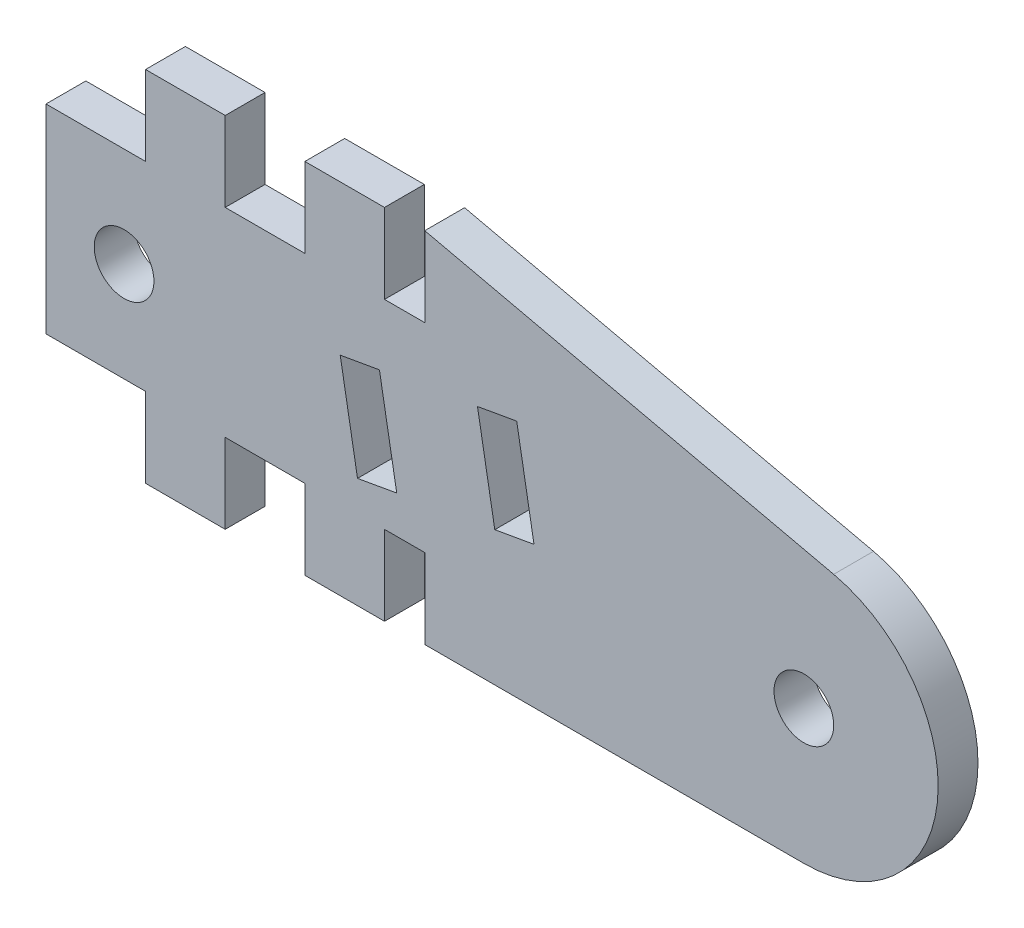
ISO-10303-21;
HEADER;
FILE_DESCRIPTION(('STEP AP214'),'2;1');
FILE_NAME('part.step','',(''),(''),'','','');
FILE_SCHEMA(('AUTOMOTIVE_DESIGN { 1 0 10303 214 1 1 1 1 }'));
ENDSEC;
DATA;
#1=APPLICATION_CONTEXT('core data for automotive mechanical design processes');
#2=APPLICATION_PROTOCOL_DEFINITION('international standard','automotive_design',2000,#1);
#3=PRODUCT_CONTEXT('',#1,'mechanical');
#4=PRODUCT('Part','Part','',(#3));
#5=PRODUCT_RELATED_PRODUCT_CATEGORY('part','',(#4));
#6=PRODUCT_DEFINITION_FORMATION('','',#4);
#7=PRODUCT_DEFINITION_CONTEXT('part definition',#1,'design');
#8=PRODUCT_DEFINITION('design','',#6,#7);
#9=PRODUCT_DEFINITION_SHAPE('','',#8);
#10=(LENGTH_UNIT() NAMED_UNIT(*) SI_UNIT(.MILLI.,.METRE.));
#11=(NAMED_UNIT(*) PLANE_ANGLE_UNIT() SI_UNIT($,.RADIAN.));
#12=(NAMED_UNIT(*) SI_UNIT($,.STERADIAN.) SOLID_ANGLE_UNIT());
#13=UNCERTAINTY_MEASURE_WITH_UNIT(LENGTH_MEASURE(1.E-05),#10,'distance_accuracy_value','');
#14=(GEOMETRIC_REPRESENTATION_CONTEXT(3) GLOBAL_UNCERTAINTY_ASSIGNED_CONTEXT((#13)) GLOBAL_UNIT_ASSIGNED_CONTEXT((#10,
#11,#12)) REPRESENTATION_CONTEXT('',''));
#15=CARTESIAN_POINT('',(0.,0.,0.));
#16=DIRECTION('',(0.,0.,1.));
#17=DIRECTION('',(1.,0.,0.));
#18=AXIS2_PLACEMENT_3D('',#15,#16,#17);
#19=CARTESIAN_POINT('',(38.05949585108,6.74534308282998,2.));
#20=DIRECTION('',(0.,0.,1.));
#21=DIRECTION('',(1.,0.,0.));
#22=AXIS2_PLACEMENT_3D('',#19,#20,#21);
#23=PLANE('',#22);
#24=CARTESIAN_POINT('',(3.92049009293526,8.99999999999998,2.));
#25=DIRECTION('',(0.,0.,1.));
#26=DIRECTION('',(1.,0.,0.));
#27=AXIS2_PLACEMENT_3D('',#24,#25,#26);
#28=CIRCLE('',#27,1.5);
#29=CARTESIAN_POINT('',(5.42049009293527,8.99999999999998,2.));
#30=VERTEX_POINT('',#29);
#31=EDGE_CURVE('E270',#30,#30,#28,.T.);
#32=ORIENTED_EDGE('',*,*,#31,.F.);
#33=EDGE_LOOP('',(#32));
#34=FACE_BOUND('',#33,.T.);
#35=DIRECTION('',(0.173648177666932,-0.984807753012208,0.));
#36=VECTOR('',#35,1.);
#37=CARTESIAN_POINT('',(14.7758795558328,10.4620193825306,2.));
#38=LINE('',#37,#36);
#39=CARTESIAN_POINT('',(14.7758795558328,10.4620193825306,2.));
#40=VERTEX_POINT('',#39);
#41=CARTESIAN_POINT('',(15.6441204441674,5.5379806174695,2.));
#42=VERTEX_POINT('',#41);
#43=EDGE_CURVE('E282',#40,#42,#38,.T.);
#44=ORIENTED_EDGE('',*,*,#43,.F.);
#45=DIRECTION('',(-0.984807753012208,-0.173648177666931,0.));
#46=VECTOR('',#45,1.);
#47=CARTESIAN_POINT('',(16.7454950618572,10.8093157378644,2.));
#48=LINE('',#47,#46);
#49=CARTESIAN_POINT('',(16.7454950618572,10.8093157378644,2.));
#50=VERTEX_POINT('',#49);
#51=EDGE_CURVE('E280',#50,#40,#48,.T.);
#52=ORIENTED_EDGE('',*,*,#51,.F.);
#53=DIRECTION('',(-0.173648177666932,0.984807753012208,0.));
#54=VECTOR('',#53,1.);
#55=CARTESIAN_POINT('',(16.7454950618572,10.8093157378644,2.));
#56=LINE('',#55,#54);
#57=CARTESIAN_POINT('',(17.6137359501918,5.88527697280338,2.));
#58=VERTEX_POINT('',#57);
#59=EDGE_CURVE('E288',#58,#50,#56,.T.);
#60=ORIENTED_EDGE('',*,*,#59,.F.);
#61=DIRECTION('',(0.984807753012206,0.173648177666941,0.));
#62=VECTOR('',#61,1.);
#63=CARTESIAN_POINT('',(15.6441204441674,5.5379806174695,2.));
#64=LINE('',#63,#62);
#65=EDGE_CURVE('E285',#42,#58,#64,.T.);
#66=ORIENTED_EDGE('',*,*,#65,.F.);
#67=EDGE_LOOP('',(#44,#52,#60,#66));
#68=FACE_BOUND('',#67,.T.);
#69=DIRECTION('',(0.,1.,0.));
#70=VECTOR('',#69,1.);
#71=CARTESIAN_POINT('',(9.,0.,2.));
#72=LINE('',#71,#70);
#73=CARTESIAN_POINT('',(9.,0.,2.));
#74=VERTEX_POINT('',#73);
#75=CARTESIAN_POINT('',(9.,4.,2.));
#76=VERTEX_POINT('',#75);
#77=EDGE_CURVE('E311',#74,#76,#72,.T.);
#78=ORIENTED_EDGE('',*,*,#77,.T.);
#79=DIRECTION('',(1.,0.,0.));
#80=VECTOR('',#79,1.);
#81=CARTESIAN_POINT('',(9.,4.,2.));
#82=LINE('',#81,#80);
#83=CARTESIAN_POINT('',(13.,4.,2.));
#84=VERTEX_POINT('',#83);
#85=EDGE_CURVE('E314',#76,#84,#82,.T.);
#86=ORIENTED_EDGE('',*,*,#85,.T.);
#87=DIRECTION('',(0.,-1.,0.));
#88=VECTOR('',#87,1.);
#89=CARTESIAN_POINT('',(13.,4.,2.));
#90=LINE('',#89,#88);
#91=CARTESIAN_POINT('',(13.,0.,2.));
#92=VERTEX_POINT('',#91);
#93=EDGE_CURVE('E317',#84,#92,#90,.T.);
#94=ORIENTED_EDGE('',*,*,#93,.T.);
#95=DIRECTION('',(1.,0.,0.));
#96=VECTOR('',#95,1.);
#97=CARTESIAN_POINT('',(13.,0.,2.));
#98=LINE('',#97,#96);
#99=CARTESIAN_POINT('',(17.,0.,2.));
#100=VERTEX_POINT('',#99);
#101=EDGE_CURVE('E319',#92,#100,#98,.T.);
#102=ORIENTED_EDGE('',*,*,#101,.T.);
#103=DIRECTION('',(0.,1.,0.));
#104=VECTOR('',#103,1.);
#105=CARTESIAN_POINT('',(17.,0.,2.));
#106=LINE('',#105,#104);
#107=CARTESIAN_POINT('',(17.,4.,2.));
#108=VERTEX_POINT('',#107);
#109=EDGE_CURVE('E321',#100,#108,#106,.T.);
#110=ORIENTED_EDGE('',*,*,#109,.T.);
#111=DIRECTION('',(1.,0.,0.));
#112=VECTOR('',#111,1.);
#113=CARTESIAN_POINT('',(17.,4.,2.));
#114=LINE('',#113,#112);
#115=CARTESIAN_POINT('',(19.0215619335038,4.,2.));
#116=VERTEX_POINT('',#115);
#117=EDGE_CURVE('E323',#108,#116,#114,.T.);
#118=ORIENTED_EDGE('',*,*,#117,.T.);
#119=DIRECTION('',(0.,-1.,0.));
#120=VECTOR('',#119,1.);
#121=CARTESIAN_POINT('',(19.0215619335038,4.,2.));
#122=LINE('',#121,#120);
#123=CARTESIAN_POINT('',(19.0215619335038,0.,2.));
#124=VERTEX_POINT('',#123);
#125=EDGE_CURVE('E325',#116,#124,#122,.T.);
#126=ORIENTED_EDGE('',*,*,#125,.T.);
#127=DIRECTION('',(1.,0.,0.));
#128=VECTOR('',#127,1.);
#129=CARTESIAN_POINT('',(19.0215619335038,0.,2.));
#130=LINE('',#129,#128);
#131=CARTESIAN_POINT('',(38.05949585108,0.,2.));
#132=VERTEX_POINT('',#131);
#133=EDGE_CURVE('E327',#124,#132,#130,.T.);
#134=ORIENTED_EDGE('',*,*,#133,.T.);
#135=CARTESIAN_POINT('',(38.05949585108,6.74534308282998,2.));
#136=DIRECTION('',(0.,0.,1.));
#137=DIRECTION('',(1.,0.,0.));
#138=AXIS2_PLACEMENT_3D('',#135,#136,#137);
#139=CIRCLE('',#138,6.74534308282998);
#140=CARTESIAN_POINT('',(39.5575990260467,13.3222222958182,2.));
#141=VERTEX_POINT('',#140);
#142=EDGE_CURVE('E329',#132,#141,#139,.T.);
#143=ORIENTED_EDGE('',*,*,#142,.T.);
#144=DIRECTION('',(-0.97502515916936,0.22209443709099,0.));
#145=VECTOR('',#144,1.);
#146=CARTESIAN_POINT('',(19.0215619335039,17.9999883567818,2.));
#147=LINE('',#146,#145);
#148=CARTESIAN_POINT('',(19.0215619335039,17.9999883567818,2.));
#149=VERTEX_POINT('',#148);
#150=EDGE_CURVE('E331',#141,#149,#147,.T.);
#151=ORIENTED_EDGE('',*,*,#150,.T.);
#152=DIRECTION('',(0.,-1.,0.));
#153=VECTOR('',#152,1.);
#154=CARTESIAN_POINT('',(19.0215619335038,13.9999883567817,2.));
#155=LINE('',#154,#153);
#156=CARTESIAN_POINT('',(19.0215619335038,13.9999883567817,2.));
#157=VERTEX_POINT('',#156);
#158=EDGE_CURVE('E333',#149,#157,#155,.T.);
#159=ORIENTED_EDGE('',*,*,#158,.T.);
#160=DIRECTION('',(-1.,0.,0.));
#161=VECTOR('',#160,1.);
#162=CARTESIAN_POINT('',(17.,13.9999883567817,2.));
#163=LINE('',#162,#161);
#164=CARTESIAN_POINT('',(17.,13.9999883567817,2.));
#165=VERTEX_POINT('',#164);
#166=EDGE_CURVE('E335',#157,#165,#163,.T.);
#167=ORIENTED_EDGE('',*,*,#166,.T.);
#168=DIRECTION('',(0.,1.,0.));
#169=VECTOR('',#168,1.);
#170=CARTESIAN_POINT('',(17.,17.9999883567817,2.));
#171=LINE('',#170,#169);
#172=CARTESIAN_POINT('',(17.,17.9999883567817,2.));
#173=VERTEX_POINT('',#172);
#174=EDGE_CURVE('E337',#165,#173,#171,.T.);
#175=ORIENTED_EDGE('',*,*,#174,.T.);
#176=DIRECTION('',(-1.,0.,0.));
#177=VECTOR('',#176,1.);
#178=CARTESIAN_POINT('',(13.,17.9999883567817,2.));
#179=LINE('',#178,#177);
#180=CARTESIAN_POINT('',(13.,17.9999883567817,2.));
#181=VERTEX_POINT('',#180);
#182=EDGE_CURVE('E339',#173,#181,#179,.T.);
#183=ORIENTED_EDGE('',*,*,#182,.T.);
#184=DIRECTION('',(0.,-1.,0.));
#185=VECTOR('',#184,1.);
#186=CARTESIAN_POINT('',(13.,13.9999883567817,2.));
#187=LINE('',#186,#185);
#188=CARTESIAN_POINT('',(13.,13.9999883567817,2.));
#189=VERTEX_POINT('',#188);
#190=EDGE_CURVE('E341',#181,#189,#187,.T.);
#191=ORIENTED_EDGE('',*,*,#190,.T.);
#192=DIRECTION('',(-1.,0.,0.));
#193=VECTOR('',#192,1.);
#194=CARTESIAN_POINT('',(9.,13.9999883567817,2.));
#195=LINE('',#194,#193);
#196=CARTESIAN_POINT('',(9.,13.9999883567817,2.));
#197=VERTEX_POINT('',#196);
#198=EDGE_CURVE('E343',#189,#197,#195,.T.);
#199=ORIENTED_EDGE('',*,*,#198,.T.);
#200=DIRECTION('',(0.,1.,0.));
#201=VECTOR('',#200,1.);
#202=CARTESIAN_POINT('',(9.,17.9999883567817,2.));
#203=LINE('',#202,#201);
#204=CARTESIAN_POINT('',(9.,17.9999883567817,2.));
#205=VERTEX_POINT('',#204);
#206=EDGE_CURVE('E345',#197,#205,#203,.T.);
#207=ORIENTED_EDGE('',*,*,#206,.T.);
#208=DIRECTION('',(-1.,0.,0.));
#209=VECTOR('',#208,1.);
#210=CARTESIAN_POINT('',(5.,17.9999883567817,2.));
#211=LINE('',#210,#209);
#212=CARTESIAN_POINT('',(5.,17.9999883567817,2.));
#213=VERTEX_POINT('',#212);
#214=EDGE_CURVE('E347',#205,#213,#211,.T.);
#215=ORIENTED_EDGE('',*,*,#214,.T.);
#216=DIRECTION('',(0.,-1.,0.));
#217=VECTOR('',#216,1.);
#218=CARTESIAN_POINT('',(5.,13.9999883567817,2.));
#219=LINE('',#218,#217);
#220=CARTESIAN_POINT('',(5.,13.9999883567817,2.));
#221=VERTEX_POINT('',#220);
#222=EDGE_CURVE('E349',#213,#221,#219,.T.);
#223=ORIENTED_EDGE('',*,*,#222,.T.);
#224=DIRECTION('',(-1.,0.,0.));
#225=VECTOR('',#224,1.);
#226=CARTESIAN_POINT('',(5.,13.9999883567817,2.));
#227=LINE('',#226,#225);
#228=CARTESIAN_POINT('',(0.,13.9999883567817,2.));
#229=VERTEX_POINT('',#228);
#230=EDGE_CURVE('E351',#221,#229,#227,.T.);
#231=ORIENTED_EDGE('',*,*,#230,.T.);
#232=DIRECTION('',(0.,-1.,0.));
#233=VECTOR('',#232,1.);
#234=CARTESIAN_POINT('',(0.,13.9999883567817,2.));
#235=LINE('',#234,#233);
#236=CARTESIAN_POINT('',(0.,4.,2.));
#237=VERTEX_POINT('',#236);
#238=EDGE_CURVE('E353',#229,#237,#235,.T.);
#239=ORIENTED_EDGE('',*,*,#238,.T.);
#240=DIRECTION('',(1.,0.,0.));
#241=VECTOR('',#240,1.);
#242=CARTESIAN_POINT('',(0.,4.,2.));
#243=LINE('',#242,#241);
#244=CARTESIAN_POINT('',(5.,4.,2.));
#245=VERTEX_POINT('',#244);
#246=EDGE_CURVE('E355',#237,#245,#243,.T.);
#247=ORIENTED_EDGE('',*,*,#246,.T.);
#248=DIRECTION('',(0.,-1.,0.));
#249=VECTOR('',#248,1.);
#250=CARTESIAN_POINT('',(5.,4.,2.));
#251=LINE('',#250,#249);
#252=CARTESIAN_POINT('',(5.,0.,2.));
#253=VERTEX_POINT('',#252);
#254=EDGE_CURVE('E357',#245,#253,#251,.T.);
#255=ORIENTED_EDGE('',*,*,#254,.T.);
#256=DIRECTION('',(1.,0.,0.));
#257=VECTOR('',#256,1.);
#258=CARTESIAN_POINT('',(5.,0.,2.));
#259=LINE('',#258,#257);
#260=EDGE_CURVE('E359',#253,#74,#259,.T.);
#261=ORIENTED_EDGE('',*,*,#260,.T.);
#262=EDGE_LOOP('',(#78,#86,#94,#102,#110,#118,#126,#134,#143,#151,#159,#167,#175,#183,#191,#199,
#207,#215,#223,#231,#239,#247,#255,#261));
#263=FACE_BOUND('',#262,.T.);
#264=DIRECTION('',(-0.984807753012208,-0.173648177666933,0.));
#265=VECTOR('',#264,1.);
#266=CARTESIAN_POINT('',(23.6391493329428,12.024852981533,2.));
#267=LINE('',#266,#265);
#268=CARTESIAN_POINT('',(23.6391493329428,12.024852981533,2.));
#269=VERTEX_POINT('',#268);
#270=CARTESIAN_POINT('',(21.6695338269183,11.6775566261991,2.));
#271=VERTEX_POINT('',#270);
#272=EDGE_CURVE('E249',#269,#271,#267,.T.);
#273=ORIENTED_EDGE('',*,*,#272,.F.);
#274=DIRECTION('',(-0.173648177666932,0.984807753012208,0.));
#275=VECTOR('',#274,1.);
#276=CARTESIAN_POINT('',(23.6391493329428,12.024852981533,2.));
#277=LINE('',#276,#275);
#278=CARTESIAN_POINT('',(24.5073902212774,7.10081421647191,2.));
#279=VERTEX_POINT('',#278);
#280=EDGE_CURVE('E241',#279,#269,#277,.T.);
#281=ORIENTED_EDGE('',*,*,#280,.F.);
#282=DIRECTION('',(0.984807753012208,0.173648177666932,0.));
#283=VECTOR('',#282,1.);
#284=CARTESIAN_POINT('',(22.537774715253,6.75351786113804,2.));
#285=LINE('',#284,#283);
#286=CARTESIAN_POINT('',(22.537774715253,6.75351786113804,2.));
#287=VERTEX_POINT('',#286);
#288=EDGE_CURVE('E264',#287,#279,#285,.T.);
#289=ORIENTED_EDGE('',*,*,#288,.F.);
#290=DIRECTION('',(0.173648177666932,-0.984807753012208,0.));
#291=VECTOR('',#290,1.);
#292=CARTESIAN_POINT('',(21.6695338269183,11.6775566261991,2.));
#293=LINE('',#292,#291);
#294=EDGE_CURVE('E262',#271,#287,#293,.T.);
#295=ORIENTED_EDGE('',*,*,#294,.F.);
#296=EDGE_LOOP('',(#273,#281,#289,#295));
#297=FACE_BOUND('',#296,.T.);
#298=CARTESIAN_POINT('',(38.05949585108,6.74534308282998,2.));
#299=DIRECTION('',(0.,0.,1.));
#300=DIRECTION('',(1.,0.,0.));
#301=AXIS2_PLACEMENT_3D('',#298,#299,#300);
#302=CIRCLE('',#301,1.5);
#303=CARTESIAN_POINT('',(39.55949585108,6.74534308282998,2.));
#304=VERTEX_POINT('',#303);
#305=EDGE_CURVE('E903',#304,#304,#302,.T.);
#306=ORIENTED_EDGE('',*,*,#305,.F.);
#307=EDGE_LOOP('',(#306));
#308=FACE_BOUND('',#307,.T.);
#309=ADVANCED_FACE('F32',(#34,#68,#263,#297,#308),#23,.T.);
#310=CARTESIAN_POINT('',(38.05949585108,6.74534308282998,0.));
#311=DIRECTION('',(0.,0.,1.));
#312=DIRECTION('',(1.,0.,0.));
#313=AXIS2_PLACEMENT_3D('',#310,#311,#312);
#314=PLANE('',#313);
#315=CARTESIAN_POINT('',(3.92049009293526,8.99999999999998,0.));
#316=DIRECTION('',(0.,0.,1.));
#317=DIRECTION('',(1.,0.,0.));
#318=AXIS2_PLACEMENT_3D('',#315,#316,#317);
#319=CIRCLE('',#318,1.5);
#320=CARTESIAN_POINT('',(5.42049009293527,8.99999999999998,0.));
#321=VERTEX_POINT('',#320);
#322=EDGE_CURVE('E909',#321,#321,#319,.T.);
#323=ORIENTED_EDGE('',*,*,#322,.T.);
#324=EDGE_LOOP('',(#323));
#325=FACE_BOUND('',#324,.T.);
#326=DIRECTION('',(-0.984807753012208,-0.173648177666931,0.));
#327=VECTOR('',#326,1.);
#328=CARTESIAN_POINT('',(16.7454950618572,10.8093157378644,0.));
#329=LINE('',#328,#327);
#330=CARTESIAN_POINT('',(16.7454950618572,10.8093157378644,0.));
#331=VERTEX_POINT('',#330);
#332=CARTESIAN_POINT('',(14.7758795558328,10.4620193825306,0.));
#333=VERTEX_POINT('',#332);
#334=EDGE_CURVE('E257',#331,#333,#329,.T.);
#335=ORIENTED_EDGE('',*,*,#334,.T.);
#336=DIRECTION('',(0.173648177666932,-0.984807753012208,0.));
#337=VECTOR('',#336,1.);
#338=CARTESIAN_POINT('',(14.7758795558328,10.4620193825306,0.));
#339=LINE('',#338,#337);
#340=CARTESIAN_POINT('',(15.6441204441674,5.5379806174695,0.));
#341=VERTEX_POINT('',#340);
#342=EDGE_CURVE('E293',#333,#341,#339,.T.);
#343=ORIENTED_EDGE('',*,*,#342,.T.);
#344=DIRECTION('',(0.984807753012206,0.173648177666941,0.));
#345=VECTOR('',#344,1.);
#346=CARTESIAN_POINT('',(15.6441204441674,5.5379806174695,0.));
#347=LINE('',#346,#345);
#348=CARTESIAN_POINT('',(17.6137359501918,5.88527697280338,0.));
#349=VERTEX_POINT('',#348);
#350=EDGE_CURVE('E296',#341,#349,#347,.T.);
#351=ORIENTED_EDGE('',*,*,#350,.T.);
#352=DIRECTION('',(-0.173648177666932,0.984807753012208,0.));
#353=VECTOR('',#352,1.);
#354=CARTESIAN_POINT('',(16.7454950618572,10.8093157378644,0.));
#355=LINE('',#354,#353);
#356=EDGE_CURVE('E283',#349,#331,#355,.T.);
#357=ORIENTED_EDGE('',*,*,#356,.T.);
#358=EDGE_LOOP('',(#335,#343,#351,#357));
#359=FACE_BOUND('',#358,.T.);
#360=DIRECTION('',(0.,1.,0.));
#361=VECTOR('',#360,1.);
#362=CARTESIAN_POINT('',(9.,0.,0.));
#363=LINE('',#362,#361);
#364=CARTESIAN_POINT('',(9.,0.,0.));
#365=VERTEX_POINT('',#364);
#366=CARTESIAN_POINT('',(9.,4.,0.));
#367=VERTEX_POINT('',#366);
#368=EDGE_CURVE('E310',#365,#367,#363,.T.);
#369=ORIENTED_EDGE('',*,*,#368,.F.);
#370=DIRECTION('',(1.,0.,0.));
#371=VECTOR('',#370,1.);
#372=CARTESIAN_POINT('',(5.,0.,0.));
#373=LINE('',#372,#371);
#374=CARTESIAN_POINT('',(5.,0.,0.));
#375=VERTEX_POINT('',#374);
#376=EDGE_CURVE('E315',#375,#365,#373,.T.);
#377=ORIENTED_EDGE('',*,*,#376,.F.);
#378=DIRECTION('',(0.,-1.,0.));
#379=VECTOR('',#378,1.);
#380=CARTESIAN_POINT('',(5.,4.,0.));
#381=LINE('',#380,#379);
#382=CARTESIAN_POINT('',(5.,4.,0.));
#383=VERTEX_POINT('',#382);
#384=EDGE_CURVE('E406',#383,#375,#381,.T.);
#385=ORIENTED_EDGE('',*,*,#384,.F.);
#386=DIRECTION('',(1.,0.,0.));
#387=VECTOR('',#386,1.);
#388=CARTESIAN_POINT('',(0.,4.,0.));
#389=LINE('',#388,#387);
#390=CARTESIAN_POINT('',(0.,4.,0.));
#391=VERTEX_POINT('',#390);
#392=EDGE_CURVE('E404',#391,#383,#389,.T.);
#393=ORIENTED_EDGE('',*,*,#392,.F.);
#394=DIRECTION('',(0.,-1.,0.));
#395=VECTOR('',#394,1.);
#396=CARTESIAN_POINT('',(0.,13.9999883567817,0.));
#397=LINE('',#396,#395);
#398=CARTESIAN_POINT('',(0.,13.9999883567817,0.));
#399=VERTEX_POINT('',#398);
#400=EDGE_CURVE('E402',#399,#391,#397,.T.);
#401=ORIENTED_EDGE('',*,*,#400,.F.);
#402=DIRECTION('',(-1.,0.,0.));
#403=VECTOR('',#402,1.);
#404=CARTESIAN_POINT('',(5.,13.9999883567817,0.));
#405=LINE('',#404,#403);
#406=CARTESIAN_POINT('',(5.,13.9999883567817,0.));
#407=VERTEX_POINT('',#406);
#408=EDGE_CURVE('E400',#407,#399,#405,.T.);
#409=ORIENTED_EDGE('',*,*,#408,.F.);
#410=DIRECTION('',(0.,-1.,0.));
#411=VECTOR('',#410,1.);
#412=CARTESIAN_POINT('',(5.,13.9999883567817,0.));
#413=LINE('',#412,#411);
#414=CARTESIAN_POINT('',(5.,17.9999883567817,0.));
#415=VERTEX_POINT('',#414);
#416=EDGE_CURVE('E398',#415,#407,#413,.T.);
#417=ORIENTED_EDGE('',*,*,#416,.F.);
#418=DIRECTION('',(-1.,0.,0.));
#419=VECTOR('',#418,1.);
#420=CARTESIAN_POINT('',(5.,17.9999883567817,0.));
#421=LINE('',#420,#419);
#422=CARTESIAN_POINT('',(9.,17.9999883567817,0.));
#423=VERTEX_POINT('',#422);
#424=EDGE_CURVE('E396',#423,#415,#421,.T.);
#425=ORIENTED_EDGE('',*,*,#424,.F.);
#426=DIRECTION('',(0.,1.,0.));
#427=VECTOR('',#426,1.);
#428=CARTESIAN_POINT('',(9.,17.9999883567817,0.));
#429=LINE('',#428,#427);
#430=CARTESIAN_POINT('',(9.,13.9999883567817,0.));
#431=VERTEX_POINT('',#430);
#432=EDGE_CURVE('E394',#431,#423,#429,.T.);
#433=ORIENTED_EDGE('',*,*,#432,.F.);
#434=DIRECTION('',(-1.,0.,0.));
#435=VECTOR('',#434,1.);
#436=CARTESIAN_POINT('',(9.,13.9999883567817,0.));
#437=LINE('',#436,#435);
#438=CARTESIAN_POINT('',(13.,13.9999883567817,0.));
#439=VERTEX_POINT('',#438);
#440=EDGE_CURVE('E392',#439,#431,#437,.T.);
#441=ORIENTED_EDGE('',*,*,#440,.F.);
#442=DIRECTION('',(0.,-1.,0.));
#443=VECTOR('',#442,1.);
#444=CARTESIAN_POINT('',(13.,13.9999883567817,0.));
#445=LINE('',#444,#443);
#446=CARTESIAN_POINT('',(13.,17.9999883567817,0.));
#447=VERTEX_POINT('',#446);
#448=EDGE_CURVE('E390',#447,#439,#445,.T.);
#449=ORIENTED_EDGE('',*,*,#448,.F.);
#450=DIRECTION('',(-1.,0.,0.));
#451=VECTOR('',#450,1.);
#452=CARTESIAN_POINT('',(13.,17.9999883567817,0.));
#453=LINE('',#452,#451);
#454=CARTESIAN_POINT('',(17.,17.9999883567817,0.));
#455=VERTEX_POINT('',#454);
#456=EDGE_CURVE('E388',#455,#447,#453,.T.);
#457=ORIENTED_EDGE('',*,*,#456,.F.);
#458=DIRECTION('',(0.,1.,0.));
#459=VECTOR('',#458,1.);
#460=CARTESIAN_POINT('',(17.,17.9999883567817,0.));
#461=LINE('',#460,#459);
#462=CARTESIAN_POINT('',(17.,13.9999883567817,0.));
#463=VERTEX_POINT('',#462);
#464=EDGE_CURVE('E386',#463,#455,#461,.T.);
#465=ORIENTED_EDGE('',*,*,#464,.F.);
#466=DIRECTION('',(-1.,0.,0.));
#467=VECTOR('',#466,1.);
#468=CARTESIAN_POINT('',(17.,13.9999883567817,0.));
#469=LINE('',#468,#467);
#470=CARTESIAN_POINT('',(19.0215619335038,13.9999883567817,0.));
#471=VERTEX_POINT('',#470);
#472=EDGE_CURVE('E384',#471,#463,#469,.T.);
#473=ORIENTED_EDGE('',*,*,#472,.F.);
#474=DIRECTION('',(0.,-1.,0.));
#475=VECTOR('',#474,1.);
#476=CARTESIAN_POINT('',(19.0215619335038,13.9999883567817,0.));
#477=LINE('',#476,#475);
#478=CARTESIAN_POINT('',(19.0215619335039,17.9999883567818,0.));
#479=VERTEX_POINT('',#478);
#480=EDGE_CURVE('E382',#479,#471,#477,.T.);
#481=ORIENTED_EDGE('',*,*,#480,.F.);
#482=DIRECTION('',(-0.97502515916936,0.22209443709099,0.));
#483=VECTOR('',#482,1.);
#484=CARTESIAN_POINT('',(19.0215619335039,17.9999883567818,0.));
#485=LINE('',#484,#483);
#486=CARTESIAN_POINT('',(39.5575990260467,13.3222222958182,0.));
#487=VERTEX_POINT('',#486);
#488=EDGE_CURVE('E380',#487,#479,#485,.T.);
#489=ORIENTED_EDGE('',*,*,#488,.F.);
#490=CARTESIAN_POINT('',(38.05949585108,6.74534308282998,0.));
#491=DIRECTION('',(0.,0.,1.));
#492=DIRECTION('',(1.,0.,0.));
#493=AXIS2_PLACEMENT_3D('',#490,#491,#492);
#494=CIRCLE('',#493,6.74534308282998);
#495=CARTESIAN_POINT('',(38.05949585108,0.,0.));
#496=VERTEX_POINT('',#495);
#497=EDGE_CURVE('E378',#496,#487,#494,.T.);
#498=ORIENTED_EDGE('',*,*,#497,.F.);
#499=DIRECTION('',(1.,0.,0.));
#500=VECTOR('',#499,1.);
#501=CARTESIAN_POINT('',(19.0215619335038,0.,0.));
#502=LINE('',#501,#500);
#503=CARTESIAN_POINT('',(19.0215619335038,0.,0.));
#504=VERTEX_POINT('',#503);
#505=EDGE_CURVE('E376',#504,#496,#502,.T.);
#506=ORIENTED_EDGE('',*,*,#505,.F.);
#507=DIRECTION('',(0.,-1.,0.));
#508=VECTOR('',#507,1.);
#509=CARTESIAN_POINT('',(19.0215619335038,4.,0.));
#510=LINE('',#509,#508);
#511=CARTESIAN_POINT('',(19.0215619335038,4.,0.));
#512=VERTEX_POINT('',#511);
#513=EDGE_CURVE('E374',#512,#504,#510,.T.);
#514=ORIENTED_EDGE('',*,*,#513,.F.);
#515=DIRECTION('',(1.,0.,0.));
#516=VECTOR('',#515,1.);
#517=CARTESIAN_POINT('',(17.,4.,0.));
#518=LINE('',#517,#516);
#519=CARTESIAN_POINT('',(17.,4.,0.));
#520=VERTEX_POINT('',#519);
#521=EDGE_CURVE('E372',#520,#512,#518,.T.);
#522=ORIENTED_EDGE('',*,*,#521,.F.);
#523=DIRECTION('',(0.,1.,0.));
#524=VECTOR('',#523,1.);
#525=CARTESIAN_POINT('',(17.,0.,0.));
#526=LINE('',#525,#524);
#527=CARTESIAN_POINT('',(17.,0.,0.));
#528=VERTEX_POINT('',#527);
#529=EDGE_CURVE('E370',#528,#520,#526,.T.);
#530=ORIENTED_EDGE('',*,*,#529,.F.);
#531=DIRECTION('',(1.,0.,0.));
#532=VECTOR('',#531,1.);
#533=CARTESIAN_POINT('',(13.,0.,0.));
#534=LINE('',#533,#532);
#535=CARTESIAN_POINT('',(13.,0.,0.));
#536=VERTEX_POINT('',#535);
#537=EDGE_CURVE('E368',#536,#528,#534,.T.);
#538=ORIENTED_EDGE('',*,*,#537,.F.);
#539=DIRECTION('',(0.,-1.,0.));
#540=VECTOR('',#539,1.);
#541=CARTESIAN_POINT('',(13.,4.,0.));
#542=LINE('',#541,#540);
#543=CARTESIAN_POINT('',(13.,4.,0.));
#544=VERTEX_POINT('',#543);
#545=EDGE_CURVE('E366',#544,#536,#542,.T.);
#546=ORIENTED_EDGE('',*,*,#545,.F.);
#547=DIRECTION('',(1.,0.,0.));
#548=VECTOR('',#547,1.);
#549=CARTESIAN_POINT('',(9.,4.,0.));
#550=LINE('',#549,#548);
#551=EDGE_CURVE('E364',#367,#544,#550,.T.);
#552=ORIENTED_EDGE('',*,*,#551,.F.);
#553=EDGE_LOOP('',(#369,#377,#385,#393,#401,#409,#417,#425,#433,#441,#449,#457,#465,#473,#481,
#489,#498,#506,#514,#522,#530,#538,#546,#552));
#554=FACE_BOUND('',#553,.T.);
#555=DIRECTION('',(-0.173648177666932,0.984807753012208,0.));
#556=VECTOR('',#555,1.);
#557=CARTESIAN_POINT('',(23.6391493329428,12.024852981533,0.));
#558=LINE('',#557,#556);
#559=CARTESIAN_POINT('',(24.5073902212774,7.10081421647191,0.));
#560=VERTEX_POINT('',#559);
#561=CARTESIAN_POINT('',(23.6391493329428,12.024852981533,0.));
#562=VERTEX_POINT('',#561);
#563=EDGE_CURVE('E55',#560,#562,#558,.T.);
#564=ORIENTED_EDGE('',*,*,#563,.T.);
#565=DIRECTION('',(-0.984807753012208,-0.173648177666933,0.));
#566=VECTOR('',#565,1.);
#567=CARTESIAN_POINT('',(23.6391493329428,12.024852981533,0.));
#568=LINE('',#567,#566);
#569=CARTESIAN_POINT('',(21.6695338269183,11.6775566261991,0.));
#570=VERTEX_POINT('',#569);
#571=EDGE_CURVE('E256',#562,#570,#568,.T.);
#572=ORIENTED_EDGE('',*,*,#571,.T.);
#573=DIRECTION('',(0.173648177666932,-0.984807753012208,0.));
#574=VECTOR('',#573,1.);
#575=CARTESIAN_POINT('',(21.6695338269183,11.6775566261991,0.));
#576=LINE('',#575,#574);
#577=CARTESIAN_POINT('',(22.537774715253,6.75351786113804,0.));
#578=VERTEX_POINT('',#577);
#579=EDGE_CURVE('E272',#570,#578,#576,.T.);
#580=ORIENTED_EDGE('',*,*,#579,.T.);
#581=DIRECTION('',(0.984807753012208,0.173648177666932,0.));
#582=VECTOR('',#581,1.);
#583=CARTESIAN_POINT('',(22.537774715253,6.75351786113804,0.));
#584=LINE('',#583,#582);
#585=EDGE_CURVE('E250',#578,#560,#584,.T.);
#586=ORIENTED_EDGE('',*,*,#585,.T.);
#587=EDGE_LOOP('',(#564,#572,#580,#586));
#588=FACE_BOUND('',#587,.T.);
#589=CARTESIAN_POINT('',(38.05949585108,6.74534308282998,0.));
#590=DIRECTION('',(0.,0.,1.));
#591=DIRECTION('',(1.,0.,0.));
#592=AXIS2_PLACEMENT_3D('',#589,#590,#591);
#593=CIRCLE('',#592,1.5);
#594=CARTESIAN_POINT('',(39.55949585108,6.74534308282998,0.));
#595=VERTEX_POINT('',#594);
#596=EDGE_CURVE('E906',#595,#595,#593,.T.);
#597=ORIENTED_EDGE('',*,*,#596,.T.);
#598=EDGE_LOOP('',(#597));
#599=FACE_BOUND('',#598,.T.);
#600=ADVANCED_FACE('F484',(#325,#359,#554,#588,#599),#314,.F.);
#601=CARTESIAN_POINT('',(9.,0.,2.));
#602=DIRECTION('',(-1.,0.,0.));
#603=DIRECTION('',(0.,0.,1.));
#604=AXIS2_PLACEMENT_3D('',#601,#602,#603);
#605=PLANE('',#604);
#606=ORIENTED_EDGE('',*,*,#368,.T.);
#607=DIRECTION('',(0.,0.,-1.));
#608=VECTOR('',#607,1.);
#609=CARTESIAN_POINT('',(9.,4.,2.));
#610=LINE('',#609,#608);
#611=EDGE_CURVE('E11',#76,#367,#610,.T.);
#612=ORIENTED_EDGE('',*,*,#611,.F.);
#613=ORIENTED_EDGE('',*,*,#77,.F.);
#614=DIRECTION('',(0.,0.,-1.));
#615=VECTOR('',#614,1.);
#616=CARTESIAN_POINT('',(9.,0.,2.));
#617=LINE('',#616,#615);
#618=EDGE_CURVE('E361',#74,#365,#617,.T.);
#619=ORIENTED_EDGE('',*,*,#618,.T.);
#620=EDGE_LOOP('',(#606,#612,#613,#619));
#621=FACE_BOUND('',#620,.T.);
#622=ADVANCED_FACE('F34',(#621),#605,.F.);
#623=CARTESIAN_POINT('',(9.,4.,2.));
#624=DIRECTION('',(0.,1.,0.));
#625=DIRECTION('',(0.,0.,1.));
#626=AXIS2_PLACEMENT_3D('',#623,#624,#625);
#627=PLANE('',#626);
#628=ORIENTED_EDGE('',*,*,#551,.T.);
#629=DIRECTION('',(0.,0.,-1.));
#630=VECTOR('',#629,1.);
#631=CARTESIAN_POINT('',(13.,4.,2.));
#632=LINE('',#631,#630);
#633=EDGE_CURVE('E40',#84,#544,#632,.T.);
#634=ORIENTED_EDGE('',*,*,#633,.F.);
#635=ORIENTED_EDGE('',*,*,#85,.F.);
#636=ORIENTED_EDGE('',*,*,#611,.T.);
#637=EDGE_LOOP('',(#628,#634,#635,#636));
#638=FACE_BOUND('',#637,.T.);
#639=ADVANCED_FACE('F501',(#638),#627,.F.);
#640=CARTESIAN_POINT('',(13.,4.,2.));
#641=DIRECTION('',(1.,0.,0.));
#642=DIRECTION('',(0.,1.,0.));
#643=AXIS2_PLACEMENT_3D('',#640,#641,#642);
#644=PLANE('',#643);
#645=ORIENTED_EDGE('',*,*,#545,.T.);
#646=DIRECTION('',(0.,0.,-1.));
#647=VECTOR('',#646,1.);
#648=CARTESIAN_POINT('',(13.,0.,2.));
#649=LINE('',#648,#647);
#650=EDGE_CURVE('E471',#92,#536,#649,.T.);
#651=ORIENTED_EDGE('',*,*,#650,.F.);
#652=ORIENTED_EDGE('',*,*,#93,.F.);
#653=ORIENTED_EDGE('',*,*,#633,.T.);
#654=EDGE_LOOP('',(#645,#651,#652,#653));
#655=FACE_BOUND('',#654,.T.);
#656=ADVANCED_FACE('F478',(#655),#644,.F.);
#657=CARTESIAN_POINT('',(13.,0.,2.));
#658=DIRECTION('',(0.,1.,0.));
#659=DIRECTION('',(-1.,0.,0.));
#660=AXIS2_PLACEMENT_3D('',#657,#658,#659);
#661=PLANE('',#660);
#662=ORIENTED_EDGE('',*,*,#537,.T.);
#663=DIRECTION('',(0.,0.,-1.));
#664=VECTOR('',#663,1.);
#665=CARTESIAN_POINT('',(17.,0.,2.));
#666=LINE('',#665,#664);
#667=EDGE_CURVE('E468',#100,#528,#666,.T.);
#668=ORIENTED_EDGE('',*,*,#667,.F.);
#669=ORIENTED_EDGE('',*,*,#101,.F.);
#670=ORIENTED_EDGE('',*,*,#650,.T.);
#671=EDGE_LOOP('',(#662,#668,#669,#670));
#672=FACE_BOUND('',#671,.T.);
#673=ADVANCED_FACE('F490',(#672),#661,.F.);
#674=CARTESIAN_POINT('',(17.,0.,2.));
#675=DIRECTION('',(-1.,0.,0.));
#676=DIRECTION('',(0.,0.,1.));
#677=AXIS2_PLACEMENT_3D('',#674,#675,#676);
#678=PLANE('',#677);
#679=ORIENTED_EDGE('',*,*,#529,.T.);
#680=DIRECTION('',(0.,0.,-1.));
#681=VECTOR('',#680,1.);
#682=CARTESIAN_POINT('',(17.,4.,2.));
#683=LINE('',#682,#681);
#684=EDGE_CURVE('E465',#108,#520,#683,.T.);
#685=ORIENTED_EDGE('',*,*,#684,.F.);
#686=ORIENTED_EDGE('',*,*,#109,.F.);
#687=ORIENTED_EDGE('',*,*,#667,.T.);
#688=EDGE_LOOP('',(#679,#685,#686,#687));
#689=FACE_BOUND('',#688,.T.);
#690=ADVANCED_FACE('F494',(#689),#678,.F.);
#691=CARTESIAN_POINT('',(17.,4.,2.));
#692=DIRECTION('',(0.,1.,0.));
#693=DIRECTION('',(0.,0.,1.));
#694=AXIS2_PLACEMENT_3D('',#691,#692,#693);
#695=PLANE('',#694);
#696=ORIENTED_EDGE('',*,*,#521,.T.);
#697=DIRECTION('',(0.,0.,-1.));
#698=VECTOR('',#697,1.);
#699=CARTESIAN_POINT('',(19.0215619335038,4.,2.));
#700=LINE('',#699,#698);
#701=EDGE_CURVE('E462',#116,#512,#700,.T.);
#702=ORIENTED_EDGE('',*,*,#701,.F.);
#703=ORIENTED_EDGE('',*,*,#117,.F.);
#704=ORIENTED_EDGE('',*,*,#684,.T.);
#705=EDGE_LOOP('',(#696,#702,#703,#704));
#706=FACE_BOUND('',#705,.T.);
#707=ADVANCED_FACE('F594',(#706),#695,.F.);
#708=CARTESIAN_POINT('',(19.0215619335038,4.,2.));
#709=DIRECTION('',(1.,0.,0.));
#710=DIRECTION('',(0.,0.,-1.));
#711=AXIS2_PLACEMENT_3D('',#708,#709,#710);
#712=PLANE('',#711);
#713=ORIENTED_EDGE('',*,*,#513,.T.);
#714=DIRECTION('',(0.,0.,-1.));
#715=VECTOR('',#714,1.);
#716=CARTESIAN_POINT('',(19.0215619335038,0.,2.));
#717=LINE('',#716,#715);
#718=EDGE_CURVE('E459',#124,#504,#717,.T.);
#719=ORIENTED_EDGE('',*,*,#718,.F.);
#720=ORIENTED_EDGE('',*,*,#125,.F.);
#721=ORIENTED_EDGE('',*,*,#701,.T.);
#722=EDGE_LOOP('',(#713,#719,#720,#721));
#723=FACE_BOUND('',#722,.T.);
#724=ADVANCED_FACE('F592',(#723),#712,.F.);
#725=CARTESIAN_POINT('',(19.0215619335038,0.,2.));
#726=DIRECTION('',(0.,1.,0.));
#727=DIRECTION('',(0.,0.,1.));
#728=AXIS2_PLACEMENT_3D('',#725,#726,#727);
#729=PLANE('',#728);
#730=ORIENTED_EDGE('',*,*,#505,.T.);
#731=DIRECTION('',(0.,0.,-1.));
#732=VECTOR('',#731,1.);
#733=CARTESIAN_POINT('',(38.05949585108,0.,2.));
#734=LINE('',#733,#732);
#735=EDGE_CURVE('E456',#132,#496,#734,.T.);
#736=ORIENTED_EDGE('',*,*,#735,.F.);
#737=ORIENTED_EDGE('',*,*,#133,.F.);
#738=ORIENTED_EDGE('',*,*,#718,.T.);
#739=EDGE_LOOP('',(#730,#736,#737,#738));
#740=FACE_BOUND('',#739,.T.);
#741=ADVANCED_FACE('F588',(#740),#729,.F.);
#742=CARTESIAN_POINT('',(38.05949585108,6.74534308282998,2.));
#743=DIRECTION('',(0.,0.,-1.));
#744=DIRECTION('',(-1.,0.,0.));
#745=AXIS2_PLACEMENT_3D('',#742,#743,#744);
#746=CYLINDRICAL_SURFACE('',#745,6.74534308282998);
#747=ORIENTED_EDGE('',*,*,#497,.T.);
#748=DIRECTION('',(0.,0.,-1.));
#749=VECTOR('',#748,1.);
#750=CARTESIAN_POINT('',(39.5575990260467,13.3222222958182,2.));
#751=LINE('',#750,#749);
#752=EDGE_CURVE('E453',#141,#487,#751,.T.);
#753=ORIENTED_EDGE('',*,*,#752,.F.);
#754=ORIENTED_EDGE('',*,*,#142,.F.);
#755=ORIENTED_EDGE('',*,*,#735,.T.);
#756=EDGE_LOOP('',(#747,#753,#754,#755));
#757=FACE_BOUND('',#756,.T.);
#758=ADVANCED_FACE('F583',(#757),#746,.T.);
#759=CARTESIAN_POINT('',(19.0215619335039,17.9999883567818,2.));
#760=DIRECTION('',(-0.22209443709099,-0.97502515916936,0.));
#761=DIRECTION('',(0.97502515916936,-0.22209443709099,0.));
#762=AXIS2_PLACEMENT_3D('',#759,#760,#761);
#763=PLANE('',#762);
#764=ORIENTED_EDGE('',*,*,#488,.T.);
#765=DIRECTION('',(0.,0.,-1.));
#766=VECTOR('',#765,1.);
#767=CARTESIAN_POINT('',(19.0215619335039,17.9999883567818,2.));
#768=LINE('',#767,#766);
#769=EDGE_CURVE('E450',#149,#479,#768,.T.);
#770=ORIENTED_EDGE('',*,*,#769,.F.);
#771=ORIENTED_EDGE('',*,*,#150,.F.);
#772=ORIENTED_EDGE('',*,*,#752,.T.);
#773=EDGE_LOOP('',(#764,#770,#771,#772));
#774=FACE_BOUND('',#773,.T.);
#775=ADVANCED_FACE('F577',(#774),#763,.F.);
#776=CARTESIAN_POINT('',(19.0215619335038,13.9999883567817,2.));
#777=DIRECTION('',(1.,0.,0.));
#778=DIRECTION('',(0.,1.,0.));
#779=AXIS2_PLACEMENT_3D('',#776,#777,#778);
#780=PLANE('',#779);
#781=ORIENTED_EDGE('',*,*,#480,.T.);
#782=DIRECTION('',(0.,0.,-1.));
#783=VECTOR('',#782,1.);
#784=CARTESIAN_POINT('',(19.0215619335038,13.9999883567817,2.));
#785=LINE('',#784,#783);
#786=EDGE_CURVE('E447',#157,#471,#785,.T.);
#787=ORIENTED_EDGE('',*,*,#786,.F.);
#788=ORIENTED_EDGE('',*,*,#158,.F.);
#789=ORIENTED_EDGE('',*,*,#769,.T.);
#790=EDGE_LOOP('',(#781,#787,#788,#789));
#791=FACE_BOUND('',#790,.T.);
#792=ADVANCED_FACE('F573',(#791),#780,.F.);
#793=CARTESIAN_POINT('',(17.,13.9999883567817,2.));
#794=DIRECTION('',(0.,-1.,0.));
#795=DIRECTION('',(0.,0.,-1.));
#796=AXIS2_PLACEMENT_3D('',#793,#794,#795);
#797=PLANE('',#796);
#798=ORIENTED_EDGE('',*,*,#472,.T.);
#799=DIRECTION('',(0.,0.,-1.));
#800=VECTOR('',#799,1.);
#801=CARTESIAN_POINT('',(17.,13.9999883567817,2.));
#802=LINE('',#801,#800);
#803=EDGE_CURVE('E444',#165,#463,#802,.T.);
#804=ORIENTED_EDGE('',*,*,#803,.F.);
#805=ORIENTED_EDGE('',*,*,#166,.F.);
#806=ORIENTED_EDGE('',*,*,#786,.T.);
#807=EDGE_LOOP('',(#798,#804,#805,#806));
#808=FACE_BOUND('',#807,.T.);
#809=ADVANCED_FACE('F568',(#808),#797,.F.);
#810=CARTESIAN_POINT('',(17.,17.9999883567817,2.));
#811=DIRECTION('',(-1.,0.,0.));
#812=DIRECTION('',(0.,-1.,0.));
#813=AXIS2_PLACEMENT_3D('',#810,#811,#812);
#814=PLANE('',#813);
#815=ORIENTED_EDGE('',*,*,#464,.T.);
#816=DIRECTION('',(0.,0.,-1.));
#817=VECTOR('',#816,1.);
#818=CARTESIAN_POINT('',(17.,17.9999883567817,2.));
#819=LINE('',#818,#817);
#820=EDGE_CURVE('E441',#173,#455,#819,.T.);
#821=ORIENTED_EDGE('',*,*,#820,.F.);
#822=ORIENTED_EDGE('',*,*,#174,.F.);
#823=ORIENTED_EDGE('',*,*,#803,.T.);
#824=EDGE_LOOP('',(#815,#821,#822,#823));
#825=FACE_BOUND('',#824,.T.);
#826=ADVANCED_FACE('F562',(#825),#814,.F.);
#827=CARTESIAN_POINT('',(13.,17.9999883567817,2.));
#828=DIRECTION('',(0.,-1.,0.));
#829=DIRECTION('',(0.,0.,-1.));
#830=AXIS2_PLACEMENT_3D('',#827,#828,#829);
#831=PLANE('',#830);
#832=ORIENTED_EDGE('',*,*,#456,.T.);
#833=DIRECTION('',(0.,0.,-1.));
#834=VECTOR('',#833,1.);
#835=CARTESIAN_POINT('',(13.,17.9999883567817,2.));
#836=LINE('',#835,#834);
#837=EDGE_CURVE('E438',#181,#447,#836,.T.);
#838=ORIENTED_EDGE('',*,*,#837,.F.);
#839=ORIENTED_EDGE('',*,*,#182,.F.);
#840=ORIENTED_EDGE('',*,*,#820,.T.);
#841=EDGE_LOOP('',(#832,#838,#839,#840));
#842=FACE_BOUND('',#841,.T.);
#843=ADVANCED_FACE('F558',(#842),#831,.F.);
#844=CARTESIAN_POINT('',(13.,13.9999883567817,2.));
#845=DIRECTION('',(1.,0.,0.));
#846=DIRECTION('',(0.,0.,-1.));
#847=AXIS2_PLACEMENT_3D('',#844,#845,#846);
#848=PLANE('',#847);
#849=ORIENTED_EDGE('',*,*,#448,.T.);
#850=DIRECTION('',(0.,0.,-1.));
#851=VECTOR('',#850,1.);
#852=CARTESIAN_POINT('',(13.,13.9999883567817,2.));
#853=LINE('',#852,#851);
#854=EDGE_CURVE('E435',#189,#439,#853,.T.);
#855=ORIENTED_EDGE('',*,*,#854,.F.);
#856=ORIENTED_EDGE('',*,*,#190,.F.);
#857=ORIENTED_EDGE('',*,*,#837,.T.);
#858=EDGE_LOOP('',(#849,#855,#856,#857));
#859=FACE_BOUND('',#858,.T.);
#860=ADVANCED_FACE('F553',(#859),#848,.F.);
#861=CARTESIAN_POINT('',(9.,13.9999883567817,2.));
#862=DIRECTION('',(0.,-1.,0.));
#863=DIRECTION('',(0.,0.,-1.));
#864=AXIS2_PLACEMENT_3D('',#861,#862,#863);
#865=PLANE('',#864);
#866=ORIENTED_EDGE('',*,*,#440,.T.);
#867=DIRECTION('',(0.,0.,-1.));
#868=VECTOR('',#867,1.);
#869=CARTESIAN_POINT('',(9.,13.9999883567817,2.));
#870=LINE('',#869,#868);
#871=EDGE_CURVE('E432',#197,#431,#870,.T.);
#872=ORIENTED_EDGE('',*,*,#871,.F.);
#873=ORIENTED_EDGE('',*,*,#198,.F.);
#874=ORIENTED_EDGE('',*,*,#854,.T.);
#875=EDGE_LOOP('',(#866,#872,#873,#874));
#876=FACE_BOUND('',#875,.T.);
#877=ADVANCED_FACE('F547',(#876),#865,.F.);
#878=CARTESIAN_POINT('',(9.,17.9999883567817,2.));
#879=DIRECTION('',(-1.,0.,0.));
#880=DIRECTION('',(0.,0.,1.));
#881=AXIS2_PLACEMENT_3D('',#878,#879,#880);
#882=PLANE('',#881);
#883=ORIENTED_EDGE('',*,*,#432,.T.);
#884=DIRECTION('',(0.,0.,-1.));
#885=VECTOR('',#884,1.);
#886=CARTESIAN_POINT('',(9.,17.9999883567817,2.));
#887=LINE('',#886,#885);
#888=EDGE_CURVE('E429',#205,#423,#887,.T.);
#889=ORIENTED_EDGE('',*,*,#888,.F.);
#890=ORIENTED_EDGE('',*,*,#206,.F.);
#891=ORIENTED_EDGE('',*,*,#871,.T.);
#892=EDGE_LOOP('',(#883,#889,#890,#891));
#893=FACE_BOUND('',#892,.T.);
#894=ADVANCED_FACE('F543',(#893),#882,.F.);
#895=CARTESIAN_POINT('',(5.,17.9999883567817,2.));
#896=DIRECTION('',(0.,-1.,0.));
#897=DIRECTION('',(0.,0.,-1.));
#898=AXIS2_PLACEMENT_3D('',#895,#896,#897);
#899=PLANE('',#898);
#900=ORIENTED_EDGE('',*,*,#424,.T.);
#901=DIRECTION('',(0.,0.,-1.));
#902=VECTOR('',#901,1.);
#903=CARTESIAN_POINT('',(5.,17.9999883567817,2.));
#904=LINE('',#903,#902);
#905=EDGE_CURVE('E426',#213,#415,#904,.T.);
#906=ORIENTED_EDGE('',*,*,#905,.F.);
#907=ORIENTED_EDGE('',*,*,#214,.F.);
#908=ORIENTED_EDGE('',*,*,#888,.T.);
#909=EDGE_LOOP('',(#900,#906,#907,#908));
#910=FACE_BOUND('',#909,.T.);
#911=ADVANCED_FACE('F538',(#910),#899,.F.);
#912=CARTESIAN_POINT('',(5.,13.9999883567817,2.));
#913=DIRECTION('',(1.,0.,0.));
#914=DIRECTION('',(0.,0.,-1.));
#915=AXIS2_PLACEMENT_3D('',#912,#913,#914);
#916=PLANE('',#915);
#917=ORIENTED_EDGE('',*,*,#416,.T.);
#918=DIRECTION('',(0.,0.,-1.));
#919=VECTOR('',#918,1.);
#920=CARTESIAN_POINT('',(5.,13.9999883567817,2.));
#921=LINE('',#920,#919);
#922=EDGE_CURVE('E423',#221,#407,#921,.T.);
#923=ORIENTED_EDGE('',*,*,#922,.F.);
#924=ORIENTED_EDGE('',*,*,#222,.F.);
#925=ORIENTED_EDGE('',*,*,#905,.T.);
#926=EDGE_LOOP('',(#917,#923,#924,#925));
#927=FACE_BOUND('',#926,.T.);
#928=ADVANCED_FACE('F532',(#927),#916,.F.);
#929=CARTESIAN_POINT('',(5.,13.9999883567817,2.));
#930=DIRECTION('',(0.,-1.,0.));
#931=DIRECTION('',(0.,0.,-1.));
#932=AXIS2_PLACEMENT_3D('',#929,#930,#931);
#933=PLANE('',#932);
#934=ORIENTED_EDGE('',*,*,#408,.T.);
#935=DIRECTION('',(0.,0.,-1.));
#936=VECTOR('',#935,1.);
#937=CARTESIAN_POINT('',(0.,13.9999883567817,2.));
#938=LINE('',#937,#936);
#939=EDGE_CURVE('E420',#229,#399,#938,.T.);
#940=ORIENTED_EDGE('',*,*,#939,.F.);
#941=ORIENTED_EDGE('',*,*,#230,.F.);
#942=ORIENTED_EDGE('',*,*,#922,.T.);
#943=EDGE_LOOP('',(#934,#940,#941,#942));
#944=FACE_BOUND('',#943,.T.);
#945=ADVANCED_FACE('F528',(#944),#933,.F.);
#946=CARTESIAN_POINT('',(0.,13.9999883567817,2.));
#947=DIRECTION('',(1.,0.,0.));
#948=DIRECTION('',(0.,1.,0.));
#949=AXIS2_PLACEMENT_3D('',#946,#947,#948);
#950=PLANE('',#949);
#951=ORIENTED_EDGE('',*,*,#400,.T.);
#952=DIRECTION('',(0.,0.,-1.));
#953=VECTOR('',#952,1.);
#954=CARTESIAN_POINT('',(0.,4.,2.));
#955=LINE('',#954,#953);
#956=EDGE_CURVE('E417',#237,#391,#955,.T.);
#957=ORIENTED_EDGE('',*,*,#956,.F.);
#958=ORIENTED_EDGE('',*,*,#238,.F.);
#959=ORIENTED_EDGE('',*,*,#939,.T.);
#960=EDGE_LOOP('',(#951,#957,#958,#959));
#961=FACE_BOUND('',#960,.T.);
#962=ADVANCED_FACE('F523',(#961),#950,.F.);
#963=CARTESIAN_POINT('',(0.,4.,2.));
#964=DIRECTION('',(0.,1.,0.));
#965=DIRECTION('',(0.,0.,1.));
#966=AXIS2_PLACEMENT_3D('',#963,#964,#965);
#967=PLANE('',#966);
#968=ORIENTED_EDGE('',*,*,#392,.T.);
#969=DIRECTION('',(0.,0.,-1.));
#970=VECTOR('',#969,1.);
#971=CARTESIAN_POINT('',(5.,4.,2.));
#972=LINE('',#971,#970);
#973=EDGE_CURVE('E414',#245,#383,#972,.T.);
#974=ORIENTED_EDGE('',*,*,#973,.F.);
#975=ORIENTED_EDGE('',*,*,#246,.F.);
#976=ORIENTED_EDGE('',*,*,#956,.T.);
#977=EDGE_LOOP('',(#968,#974,#975,#976));
#978=FACE_BOUND('',#977,.T.);
#979=ADVANCED_FACE('F517',(#978),#967,.F.);
#980=CARTESIAN_POINT('',(5.,4.,2.));
#981=DIRECTION('',(1.,0.,0.));
#982=DIRECTION('',(0.,0.,-1.));
#983=AXIS2_PLACEMENT_3D('',#980,#981,#982);
#984=PLANE('',#983);
#985=ORIENTED_EDGE('',*,*,#384,.T.);
#986=DIRECTION('',(0.,0.,-1.));
#987=VECTOR('',#986,1.);
#988=CARTESIAN_POINT('',(5.,0.,2.));
#989=LINE('',#988,#987);
#990=EDGE_CURVE('E411',#253,#375,#989,.T.);
#991=ORIENTED_EDGE('',*,*,#990,.F.);
#992=ORIENTED_EDGE('',*,*,#254,.F.);
#993=ORIENTED_EDGE('',*,*,#973,.T.);
#994=EDGE_LOOP('',(#985,#991,#992,#993));
#995=FACE_BOUND('',#994,.T.);
#996=ADVANCED_FACE('F513',(#995),#984,.F.);
#997=CARTESIAN_POINT('',(5.,0.,2.));
#998=DIRECTION('',(0.,1.,0.));
#999=DIRECTION('',(0.,0.,1.));
#1000=AXIS2_PLACEMENT_3D('',#997,#998,#999);
#1001=PLANE('',#1000);
#1002=ORIENTED_EDGE('',*,*,#376,.T.);
#1003=ORIENTED_EDGE('',*,*,#618,.F.);
#1004=ORIENTED_EDGE('',*,*,#260,.F.);
#1005=ORIENTED_EDGE('',*,*,#990,.T.);
#1006=EDGE_LOOP('',(#1002,#1003,#1004,#1005));
#1007=FACE_BOUND('',#1006,.T.);
#1008=ADVANCED_FACE('F508',(#1007),#1001,.F.);
#1009=CARTESIAN_POINT('',(16.7454950618572,10.8093157378644,2.));
#1010=DIRECTION('',(0.173648177666931,-0.984807753012208,0.));
#1011=DIRECTION('',(0.984807753012208,0.173648177666931,0.));
#1012=AXIS2_PLACEMENT_3D('',#1009,#1010,#1011);
#1013=PLANE('',#1012);
#1014=ORIENTED_EDGE('',*,*,#334,.F.);
#1015=DIRECTION('',(0.,0.,-1.));
#1016=VECTOR('',#1015,1.);
#1017=CARTESIAN_POINT('',(16.7454950618572,10.8093157378644,2.));
#1018=LINE('',#1017,#1016);
#1019=EDGE_CURVE('E290',#50,#331,#1018,.T.);
#1020=ORIENTED_EDGE('',*,*,#1019,.F.);
#1021=ORIENTED_EDGE('',*,*,#51,.T.);
#1022=DIRECTION('',(0.,0.,-1.));
#1023=VECTOR('',#1022,1.);
#1024=CARTESIAN_POINT('',(14.7758795558328,10.4620193825306,2.));
#1025=LINE('',#1024,#1023);
#1026=EDGE_CURVE('E307',#40,#333,#1025,.T.);
#1027=ORIENTED_EDGE('',*,*,#1026,.T.);
#1028=EDGE_LOOP('',(#1014,#1020,#1021,#1027));
#1029=FACE_BOUND('',#1028,.T.);
#1030=ADVANCED_FACE('F614',(#1029),#1013,.T.);
#1031=CARTESIAN_POINT('',(14.7758795558328,10.4620193825306,2.));
#1032=DIRECTION('',(0.984807753012208,0.173648177666932,0.));
#1033=DIRECTION('',(-0.173648177666932,0.984807753012208,0.));
#1034=AXIS2_PLACEMENT_3D('',#1031,#1032,#1033);
#1035=PLANE('',#1034);
#1036=ORIENTED_EDGE('',*,*,#342,.F.);
#1037=ORIENTED_EDGE('',*,*,#1026,.F.);
#1038=ORIENTED_EDGE('',*,*,#43,.T.);
#1039=DIRECTION('',(0.,0.,-1.));
#1040=VECTOR('',#1039,1.);
#1041=CARTESIAN_POINT('',(15.6441204441674,5.5379806174695,2.));
#1042=LINE('',#1041,#1040);
#1043=EDGE_CURVE('E305',#42,#341,#1042,.T.);
#1044=ORIENTED_EDGE('',*,*,#1043,.T.);
#1045=EDGE_LOOP('',(#1036,#1037,#1038,#1044));
#1046=FACE_BOUND('',#1045,.T.);
#1047=ADVANCED_FACE('F724',(#1046),#1035,.T.);
#1048=CARTESIAN_POINT('',(15.6441204441674,5.5379806174695,2.));
#1049=DIRECTION('',(-0.173648177666941,0.984807753012206,0.));
#1050=DIRECTION('',(-0.984807753012206,-0.173648177666941,0.));
#1051=AXIS2_PLACEMENT_3D('',#1048,#1049,#1050);
#1052=PLANE('',#1051);
#1053=ORIENTED_EDGE('',*,*,#350,.F.);
#1054=ORIENTED_EDGE('',*,*,#1043,.F.);
#1055=ORIENTED_EDGE('',*,*,#65,.T.);
#1056=DIRECTION('',(0.,0.,-1.));
#1057=VECTOR('',#1056,1.);
#1058=CARTESIAN_POINT('',(17.6137359501918,5.88527697280338,2.));
#1059=LINE('',#1058,#1057);
#1060=EDGE_CURVE('E303',#58,#349,#1059,.T.);
#1061=ORIENTED_EDGE('',*,*,#1060,.T.);
#1062=EDGE_LOOP('',(#1053,#1054,#1055,#1061));
#1063=FACE_BOUND('',#1062,.T.);
#1064=ADVANCED_FACE('F731',(#1063),#1052,.T.);
#1065=CARTESIAN_POINT('',(16.7454950618572,10.8093157378644,2.));
#1066=DIRECTION('',(-0.984807753012208,-0.173648177666932,0.));
#1067=DIRECTION('',(0.173648177666932,-0.984807753012208,0.));
#1068=AXIS2_PLACEMENT_3D('',#1065,#1066,#1067);
#1069=PLANE('',#1068);
#1070=ORIENTED_EDGE('',*,*,#356,.F.);
#1071=ORIENTED_EDGE('',*,*,#1060,.F.);
#1072=ORIENTED_EDGE('',*,*,#59,.T.);
#1073=ORIENTED_EDGE('',*,*,#1019,.T.);
#1074=EDGE_LOOP('',(#1070,#1071,#1072,#1073));
#1075=FACE_BOUND('',#1074,.T.);
#1076=ADVANCED_FACE('F738',(#1075),#1069,.T.);
#1077=CARTESIAN_POINT('',(23.6391493329428,12.024852981533,2.));
#1078=DIRECTION('',(-0.984807753012208,-0.173648177666932,0.));
#1079=DIRECTION('',(0.173648177666932,-0.984807753012208,0.));
#1080=AXIS2_PLACEMENT_3D('',#1077,#1078,#1079);
#1081=PLANE('',#1080);
#1082=ORIENTED_EDGE('',*,*,#563,.F.);
#1083=DIRECTION('',(0.,0.,-1.));
#1084=VECTOR('',#1083,1.);
#1085=CARTESIAN_POINT('',(24.5073902212774,7.10081421647191,2.));
#1086=LINE('',#1085,#1084);
#1087=EDGE_CURVE('E245',#279,#560,#1086,.T.);
#1088=ORIENTED_EDGE('',*,*,#1087,.F.);
#1089=ORIENTED_EDGE('',*,*,#280,.T.);
#1090=DIRECTION('',(0.,0.,-1.));
#1091=VECTOR('',#1090,1.);
#1092=CARTESIAN_POINT('',(23.6391493329428,12.024852981533,2.));
#1093=LINE('',#1092,#1091);
#1094=EDGE_CURVE('E244',#269,#562,#1093,.T.);
#1095=ORIENTED_EDGE('',*,*,#1094,.T.);
#1096=EDGE_LOOP('',(#1082,#1088,#1089,#1095));
#1097=FACE_BOUND('',#1096,.T.);
#1098=ADVANCED_FACE('F243',(#1097),#1081,.T.);
#1099=CARTESIAN_POINT('',(23.6391493329428,12.024852981533,2.));
#1100=DIRECTION('',(0.173648177666933,-0.984807753012208,0.));
#1101=DIRECTION('',(0.984807753012208,0.173648177666933,0.));
#1102=AXIS2_PLACEMENT_3D('',#1099,#1100,#1101);
#1103=PLANE('',#1102);
#1104=ORIENTED_EDGE('',*,*,#571,.F.);
#1105=ORIENTED_EDGE('',*,*,#1094,.F.);
#1106=ORIENTED_EDGE('',*,*,#272,.T.);
#1107=DIRECTION('',(0.,0.,-1.));
#1108=VECTOR('',#1107,1.);
#1109=CARTESIAN_POINT('',(21.6695338269183,11.6775566261991,2.));
#1110=LINE('',#1109,#1108);
#1111=EDGE_CURVE('E258',#271,#570,#1110,.T.);
#1112=ORIENTED_EDGE('',*,*,#1111,.T.);
#1113=EDGE_LOOP('',(#1104,#1105,#1106,#1112));
#1114=FACE_BOUND('',#1113,.T.);
#1115=ADVANCED_FACE('F253',(#1114),#1103,.T.);
#1116=CARTESIAN_POINT('',(21.6695338269183,11.6775566261991,2.));
#1117=DIRECTION('',(0.984807753012208,0.173648177666932,0.));
#1118=DIRECTION('',(-0.173648177666932,0.984807753012208,0.));
#1119=AXIS2_PLACEMENT_3D('',#1116,#1117,#1118);
#1120=PLANE('',#1119);
#1121=ORIENTED_EDGE('',*,*,#579,.F.);
#1122=ORIENTED_EDGE('',*,*,#1111,.F.);
#1123=ORIENTED_EDGE('',*,*,#294,.T.);
#1124=DIRECTION('',(0.,0.,-1.));
#1125=VECTOR('',#1124,1.);
#1126=CARTESIAN_POINT('',(22.537774715253,6.75351786113804,2.));
#1127=LINE('',#1126,#1125);
#1128=EDGE_CURVE('E47',#287,#578,#1127,.T.);
#1129=ORIENTED_EDGE('',*,*,#1128,.T.);
#1130=EDGE_LOOP('',(#1121,#1122,#1123,#1129));
#1131=FACE_BOUND('',#1130,.T.);
#1132=ADVANCED_FACE('F759',(#1131),#1120,.T.);
#1133=CARTESIAN_POINT('',(22.537774715253,6.75351786113804,2.));
#1134=DIRECTION('',(-0.173648177666932,0.984807753012208,0.));
#1135=DIRECTION('',(-0.984807753012208,-0.173648177666932,0.));
#1136=AXIS2_PLACEMENT_3D('',#1133,#1134,#1135);
#1137=PLANE('',#1136);
#1138=ORIENTED_EDGE('',*,*,#585,.F.);
#1139=ORIENTED_EDGE('',*,*,#1128,.F.);
#1140=ORIENTED_EDGE('',*,*,#288,.T.);
#1141=ORIENTED_EDGE('',*,*,#1087,.T.);
#1142=EDGE_LOOP('',(#1138,#1139,#1140,#1141));
#1143=FACE_BOUND('',#1142,.T.);
#1144=ADVANCED_FACE('F766',(#1143),#1137,.T.);
#1145=CARTESIAN_POINT('',(3.92049009293526,8.99999999999998,2.));
#1146=DIRECTION('',(0.,0.,-1.));
#1147=DIRECTION('',(-1.,0.,0.));
#1148=AXIS2_PLACEMENT_3D('',#1145,#1146,#1147);
#1149=CYLINDRICAL_SURFACE('',#1148,1.5);
#1150=ORIENTED_EDGE('',*,*,#31,.T.);
#1151=EDGE_LOOP('',(#1150));
#1152=FACE_BOUND('',#1151,.T.);
#1153=ORIENTED_EDGE('',*,*,#322,.F.);
#1154=EDGE_LOOP('',(#1153));
#1155=FACE_BOUND('',#1154,.T.);
#1156=ADVANCED_FACE('F774',(#1152,#1155),#1149,.F.);
#1157=CARTESIAN_POINT('',(38.05949585108,6.74534308282998,2.));
#1158=DIRECTION('',(0.,0.,-1.));
#1159=DIRECTION('',(-1.,0.,0.));
#1160=AXIS2_PLACEMENT_3D('',#1157,#1158,#1159);
#1161=CYLINDRICAL_SURFACE('',#1160,1.5);
#1162=ORIENTED_EDGE('',*,*,#305,.T.);
#1163=EDGE_LOOP('',(#1162));
#1164=FACE_BOUND('',#1163,.T.);
#1165=ORIENTED_EDGE('',*,*,#596,.F.);
#1166=EDGE_LOOP('',(#1165));
#1167=FACE_BOUND('',#1166,.T.);
#1168=ADVANCED_FACE('F781',(#1164,#1167),#1161,.F.);
#1169=CLOSED_SHELL('',(#309,#600,#622,#639,#656,#673,#690,#707,#724,#741,#758,#775,#792,#809,
#826,#843,#860,#877,#894,#911,#928,#945,#962,#979,#996,#1008,#1030,#1047,#1064,#1076,#1098,
#1115,#1132,#1144,#1156,#1168));
#1170=MANIFOLD_SOLID_BREP('B2',#1169);
#1171=ADVANCED_BREP_SHAPE_REPRESENTATION('',(#18,#1170),#14);
#1172=SHAPE_DEFINITION_REPRESENTATION(#9,#1171);
ENDSEC;
END-ISO-10303-21;
